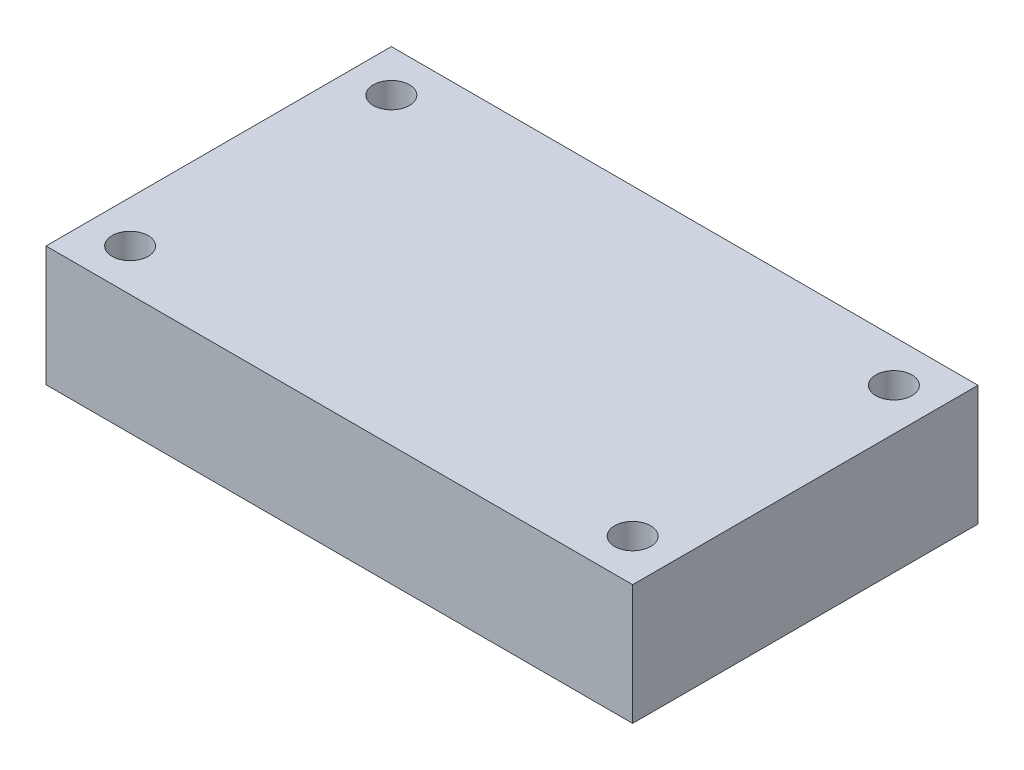
ISO-10303-21;
HEADER;
FILE_DESCRIPTION(('STEP AP214'),'2;1');
FILE_NAME('part.step','',(''),(''),'','','');
FILE_SCHEMA(('AUTOMOTIVE_DESIGN { 1 0 10303 214 1 1 1 1 }'));
ENDSEC;
DATA;
#1=APPLICATION_CONTEXT('core data for automotive mechanical design processes');
#2=APPLICATION_PROTOCOL_DEFINITION('international standard','automotive_design',2000,#1);
#3=PRODUCT_CONTEXT('',#1,'mechanical');
#4=PRODUCT('Part','Part','',(#3));
#5=PRODUCT_RELATED_PRODUCT_CATEGORY('part','',(#4));
#6=PRODUCT_DEFINITION_FORMATION('','',#4);
#7=PRODUCT_DEFINITION_CONTEXT('part definition',#1,'design');
#8=PRODUCT_DEFINITION('design','',#6,#7);
#9=PRODUCT_DEFINITION_SHAPE('','',#8);
#10=(LENGTH_UNIT() NAMED_UNIT(*) SI_UNIT(.MILLI.,.METRE.));
#11=(NAMED_UNIT(*) PLANE_ANGLE_UNIT() SI_UNIT($,.RADIAN.));
#12=(NAMED_UNIT(*) SI_UNIT($,.STERADIAN.) SOLID_ANGLE_UNIT());
#13=UNCERTAINTY_MEASURE_WITH_UNIT(LENGTH_MEASURE(1.E-05),#10,'distance_accuracy_value','');
#14=(GEOMETRIC_REPRESENTATION_CONTEXT(3) GLOBAL_UNCERTAINTY_ASSIGNED_CONTEXT((#13)) GLOBAL_UNIT_ASSIGNED_CONTEXT((#10,
#11,#12)) REPRESENTATION_CONTEXT('',''));
#15=CARTESIAN_POINT('',(0.,0.,0.));
#16=DIRECTION('',(0.,0.,1.));
#17=DIRECTION('',(1.,0.,0.));
#18=AXIS2_PLACEMENT_3D('',#15,#16,#17);
#19=CARTESIAN_POINT('',(31.,12.7,18.25));
#20=DIRECTION('',(-1.,0.,0.));
#21=DIRECTION('',(0.,0.,1.));
#22=AXIS2_PLACEMENT_3D('',#19,#20,#21);
#23=PLANE('',#22);
#24=DIRECTION('',(0.,0.,-1.));
#25=VECTOR('',#24,1.);
#26=CARTESIAN_POINT('',(31.,0.,18.25));
#27=LINE('',#26,#25);
#28=CARTESIAN_POINT('',(31.,0.,18.25));
#29=VERTEX_POINT('',#28);
#30=CARTESIAN_POINT('',(31.,0.,-18.25));
#31=VERTEX_POINT('',#30);
#32=EDGE_CURVE('E102',#29,#31,#27,.T.);
#33=ORIENTED_EDGE('',*,*,#32,.T.);
#34=DIRECTION('',(0.,-1.,0.));
#35=VECTOR('',#34,1.);
#36=CARTESIAN_POINT('',(31.,12.7,-18.25));
#37=LINE('',#36,#35);
#38=CARTESIAN_POINT('',(31.,12.7,-18.25));
#39=VERTEX_POINT('',#38);
#40=EDGE_CURVE('E11',#39,#31,#37,.T.);
#41=ORIENTED_EDGE('',*,*,#40,.F.);
#42=DIRECTION('',(0.,0.,-1.));
#43=VECTOR('',#42,1.);
#44=CARTESIAN_POINT('',(31.,12.7,18.25));
#45=LINE('',#44,#43);
#46=CARTESIAN_POINT('',(31.,12.7,18.25));
#47=VERTEX_POINT('',#46);
#48=EDGE_CURVE('E90',#47,#39,#45,.T.);
#49=ORIENTED_EDGE('',*,*,#48,.F.);
#50=DIRECTION('',(0.,-1.,0.));
#51=VECTOR('',#50,1.);
#52=CARTESIAN_POINT('',(31.,12.7,18.25));
#53=LINE('',#52,#51);
#54=EDGE_CURVE('E98',#47,#29,#53,.T.);
#55=ORIENTED_EDGE('',*,*,#54,.T.);
#56=EDGE_LOOP('',(#33,#41,#49,#55));
#57=FACE_BOUND('',#56,.T.);
#58=ADVANCED_FACE('F39',(#57),#23,.F.);
#59=CARTESIAN_POINT('',(-31.,12.7,-18.25));
#60=DIRECTION('',(0.,0.,1.));
#61=DIRECTION('',(1.,0.,0.));
#62=AXIS2_PLACEMENT_3D('',#59,#60,#61);
#63=PLANE('',#62);
#64=DIRECTION('',(-1.,0.,0.));
#65=VECTOR('',#64,1.);
#66=CARTESIAN_POINT('',(-31.,0.,-18.25));
#67=LINE('',#66,#65);
#68=CARTESIAN_POINT('',(-31.,0.,-18.25));
#69=VERTEX_POINT('',#68);
#70=EDGE_CURVE('E94',#31,#69,#67,.T.);
#71=ORIENTED_EDGE('',*,*,#70,.T.);
#72=DIRECTION('',(0.,-1.,0.));
#73=VECTOR('',#72,1.);
#74=CARTESIAN_POINT('',(-31.,12.7,-18.25));
#75=LINE('',#74,#73);
#76=CARTESIAN_POINT('',(-31.,12.7,-18.25));
#77=VERTEX_POINT('',#76);
#78=EDGE_CURVE('E47',#77,#69,#75,.T.);
#79=ORIENTED_EDGE('',*,*,#78,.F.);
#80=DIRECTION('',(-1.,0.,0.));
#81=VECTOR('',#80,1.);
#82=CARTESIAN_POINT('',(-31.,12.7,-18.25));
#83=LINE('',#82,#81);
#84=EDGE_CURVE('E85',#39,#77,#83,.T.);
#85=ORIENTED_EDGE('',*,*,#84,.F.);
#86=ORIENTED_EDGE('',*,*,#40,.T.);
#87=EDGE_LOOP('',(#71,#79,#85,#86));
#88=FACE_BOUND('',#87,.T.);
#89=ADVANCED_FACE('F93',(#88),#63,.F.);
#90=CARTESIAN_POINT('',(-31.,12.7,18.25));
#91=DIRECTION('',(1.,0.,0.));
#92=DIRECTION('',(0.,0.,-1.));
#93=AXIS2_PLACEMENT_3D('',#90,#91,#92);
#94=PLANE('',#93);
#95=DIRECTION('',(0.,0.,1.));
#96=VECTOR('',#95,1.);
#97=CARTESIAN_POINT('',(-31.,0.,18.25));
#98=LINE('',#97,#96);
#99=CARTESIAN_POINT('',(-31.,0.,18.25));
#100=VERTEX_POINT('',#99);
#101=EDGE_CURVE('E72',#69,#100,#98,.T.);
#102=ORIENTED_EDGE('',*,*,#101,.T.);
#103=DIRECTION('',(0.,-1.,0.));
#104=VECTOR('',#103,1.);
#105=CARTESIAN_POINT('',(-31.,12.7,18.25));
#106=LINE('',#105,#104);
#107=CARTESIAN_POINT('',(-31.,12.7,18.25));
#108=VERTEX_POINT('',#107);
#109=EDGE_CURVE('E95',#108,#100,#106,.T.);
#110=ORIENTED_EDGE('',*,*,#109,.F.);
#111=DIRECTION('',(0.,0.,1.));
#112=VECTOR('',#111,1.);
#113=CARTESIAN_POINT('',(-31.,12.7,18.25));
#114=LINE('',#113,#112);
#115=EDGE_CURVE('E88',#77,#108,#114,.T.);
#116=ORIENTED_EDGE('',*,*,#115,.F.);
#117=ORIENTED_EDGE('',*,*,#78,.T.);
#118=EDGE_LOOP('',(#102,#110,#116,#117));
#119=FACE_BOUND('',#118,.T.);
#120=ADVANCED_FACE('F96',(#119),#94,.F.);
#121=CARTESIAN_POINT('',(-31.,12.7,18.25));
#122=DIRECTION('',(0.,0.,-1.));
#123=DIRECTION('',(-1.,0.,0.));
#124=AXIS2_PLACEMENT_3D('',#121,#122,#123);
#125=PLANE('',#124);
#126=DIRECTION('',(1.,0.,0.));
#127=VECTOR('',#126,1.);
#128=CARTESIAN_POINT('',(-31.,0.,18.25));
#129=LINE('',#128,#127);
#130=EDGE_CURVE('E78',#100,#29,#129,.T.);
#131=ORIENTED_EDGE('',*,*,#130,.T.);
#132=ORIENTED_EDGE('',*,*,#54,.F.);
#133=DIRECTION('',(1.,0.,0.));
#134=VECTOR('',#133,1.);
#135=CARTESIAN_POINT('',(-31.,12.7,18.25));
#136=LINE('',#135,#134);
#137=EDGE_CURVE('E55',#108,#47,#136,.T.);
#138=ORIENTED_EDGE('',*,*,#137,.F.);
#139=ORIENTED_EDGE('',*,*,#109,.T.);
#140=EDGE_LOOP('',(#131,#132,#138,#139));
#141=FACE_BOUND('',#140,.T.);
#142=ADVANCED_FACE('F110',(#141),#125,.F.);
#143=CARTESIAN_POINT('',(0.,12.7,0.));
#144=DIRECTION('',(0.,-1.,0.));
#145=DIRECTION('',(0.,0.,-1.));
#146=AXIS2_PLACEMENT_3D('',#143,#144,#145);
#147=PLANE('',#146);
#148=CARTESIAN_POINT('',(26.555,12.7,13.805));
#149=DIRECTION('',(0.,1.,0.));
#150=DIRECTION('',(0.,0.,1.));
#151=AXIS2_PLACEMENT_3D('',#148,#149,#150);
#152=CIRCLE('',#151,1.905);
#153=CARTESIAN_POINT('',(26.555,12.7,15.71));
#154=VERTEX_POINT('',#153);
#155=EDGE_CURVE('E121',#154,#154,#152,.T.);
#156=ORIENTED_EDGE('',*,*,#155,.F.);
#157=EDGE_LOOP('',(#156));
#158=FACE_BOUND('',#157,.T.);
#159=CARTESIAN_POINT('',(-26.555,12.7,-13.805));
#160=DIRECTION('',(0.,1.,0.));
#161=DIRECTION('',(0.,0.,1.));
#162=AXIS2_PLACEMENT_3D('',#159,#160,#161);
#163=CIRCLE('',#162,1.905);
#164=CARTESIAN_POINT('',(-26.555,12.7,-11.9));
#165=VERTEX_POINT('',#164);
#166=EDGE_CURVE('E122',#165,#165,#163,.T.);
#167=ORIENTED_EDGE('',*,*,#166,.F.);
#168=EDGE_LOOP('',(#167));
#169=FACE_BOUND('',#168,.T.);
#170=CARTESIAN_POINT('',(-26.555,12.7,13.805));
#171=DIRECTION('',(0.,1.,0.));
#172=DIRECTION('',(0.,0.,1.));
#173=AXIS2_PLACEMENT_3D('',#170,#171,#172);
#174=CIRCLE('',#173,1.905);
#175=CARTESIAN_POINT('',(-26.555,12.7,15.71));
#176=VERTEX_POINT('',#175);
#177=EDGE_CURVE('E129',#176,#176,#174,.T.);
#178=ORIENTED_EDGE('',*,*,#177,.F.);
#179=EDGE_LOOP('',(#178));
#180=FACE_BOUND('',#179,.T.);
#181=CARTESIAN_POINT('',(26.555,12.7,-13.805));
#182=DIRECTION('',(0.,1.,0.));
#183=DIRECTION('',(0.,0.,1.));
#184=AXIS2_PLACEMENT_3D('',#181,#182,#183);
#185=CIRCLE('',#184,1.905);
#186=CARTESIAN_POINT('',(26.555,12.7,-11.9));
#187=VERTEX_POINT('',#186);
#188=EDGE_CURVE('E118',#187,#187,#185,.T.);
#189=ORIENTED_EDGE('',*,*,#188,.F.);
#190=EDGE_LOOP('',(#189));
#191=FACE_BOUND('',#190,.T.);
#192=ORIENTED_EDGE('',*,*,#48,.T.);
#193=ORIENTED_EDGE('',*,*,#84,.T.);
#194=ORIENTED_EDGE('',*,*,#115,.T.);
#195=ORIENTED_EDGE('',*,*,#137,.T.);
#196=EDGE_LOOP('',(#192,#193,#194,#195));
#197=FACE_BOUND('',#196,.T.);
#198=ADVANCED_FACE('F86',(#158,#169,#180,#191,#197),#147,.F.);
#199=CARTESIAN_POINT('',(0.,0.,0.));
#200=DIRECTION('',(0.,-1.,0.));
#201=DIRECTION('',(0.,0.,-1.));
#202=AXIS2_PLACEMENT_3D('',#199,#200,#201);
#203=PLANE('',#202);
#204=CARTESIAN_POINT('',(26.555,0.,13.805));
#205=DIRECTION('',(0.,-1.,0.));
#206=DIRECTION('',(0.,0.,-1.));
#207=AXIS2_PLACEMENT_3D('',#204,#205,#206);
#208=CIRCLE('',#207,1.905);
#209=CARTESIAN_POINT('',(26.555,0.,11.9));
#210=VERTEX_POINT('',#209);
#211=EDGE_CURVE('E125',#210,#210,#208,.F.);
#212=ORIENTED_EDGE('',*,*,#211,.T.);
#213=EDGE_LOOP('',(#212));
#214=FACE_BOUND('',#213,.T.);
#215=CARTESIAN_POINT('',(-26.555,0.,-13.805));
#216=DIRECTION('',(0.,-1.,0.));
#217=DIRECTION('',(0.,0.,-1.));
#218=AXIS2_PLACEMENT_3D('',#215,#216,#217);
#219=CIRCLE('',#218,1.905);
#220=CARTESIAN_POINT('',(-26.555,0.,-15.71));
#221=VERTEX_POINT('',#220);
#222=EDGE_CURVE('E126',#221,#221,#219,.F.);
#223=ORIENTED_EDGE('',*,*,#222,.T.);
#224=EDGE_LOOP('',(#223));
#225=FACE_BOUND('',#224,.T.);
#226=CARTESIAN_POINT('',(-26.555,0.,13.805));
#227=DIRECTION('',(0.,-1.,0.));
#228=DIRECTION('',(0.,0.,-1.));
#229=AXIS2_PLACEMENT_3D('',#226,#227,#228);
#230=CIRCLE('',#229,1.905);
#231=CARTESIAN_POINT('',(-26.555,0.,11.9));
#232=VERTEX_POINT('',#231);
#233=EDGE_CURVE('E136',#232,#232,#230,.F.);
#234=ORIENTED_EDGE('',*,*,#233,.T.);
#235=EDGE_LOOP('',(#234));
#236=FACE_BOUND('',#235,.T.);
#237=CARTESIAN_POINT('',(26.555,0.,-13.805));
#238=DIRECTION('',(0.,-1.,0.));
#239=DIRECTION('',(0.,0.,-1.));
#240=AXIS2_PLACEMENT_3D('',#237,#238,#239);
#241=CIRCLE('',#240,1.905);
#242=CARTESIAN_POINT('',(26.555,0.,-15.71));
#243=VERTEX_POINT('',#242);
#244=EDGE_CURVE('E105',#243,#243,#241,.F.);
#245=ORIENTED_EDGE('',*,*,#244,.T.);
#246=EDGE_LOOP('',(#245));
#247=FACE_BOUND('',#246,.T.);
#248=ORIENTED_EDGE('',*,*,#32,.F.);
#249=ORIENTED_EDGE('',*,*,#130,.F.);
#250=ORIENTED_EDGE('',*,*,#101,.F.);
#251=ORIENTED_EDGE('',*,*,#70,.F.);
#252=EDGE_LOOP('',(#248,#249,#250,#251));
#253=FACE_BOUND('',#252,.T.);
#254=ADVANCED_FACE('F113',(#214,#225,#236,#247,#253),#203,.T.);
#255=CARTESIAN_POINT('',(26.555,-5.3881536726415,-13.805));
#256=DIRECTION('',(0.,1.,0.));
#257=DIRECTION('',(0.,0.,1.));
#258=AXIS2_PLACEMENT_3D('',#255,#256,#257);
#259=CYLINDRICAL_SURFACE('',#258,1.905);
#260=ORIENTED_EDGE('',*,*,#188,.T.);
#261=EDGE_LOOP('',(#260));
#262=FACE_BOUND('',#261,.T.);
#263=ORIENTED_EDGE('',*,*,#244,.F.);
#264=EDGE_LOOP('',(#263));
#265=FACE_BOUND('',#264,.T.);
#266=ADVANCED_FACE('F145',(#262,#265),#259,.F.);
#267=CARTESIAN_POINT('',(-26.555,-5.3881536726415,13.805));
#268=DIRECTION('',(0.,1.,0.));
#269=DIRECTION('',(0.,0.,1.));
#270=AXIS2_PLACEMENT_3D('',#267,#268,#269);
#271=CYLINDRICAL_SURFACE('',#270,1.905);
#272=ORIENTED_EDGE('',*,*,#177,.T.);
#273=EDGE_LOOP('',(#272));
#274=FACE_BOUND('',#273,.T.);
#275=ORIENTED_EDGE('',*,*,#233,.F.);
#276=EDGE_LOOP('',(#275));
#277=FACE_BOUND('',#276,.T.);
#278=ADVANCED_FACE('F142',(#274,#277),#271,.F.);
#279=CARTESIAN_POINT('',(-26.555,-5.3881536726415,-13.805));
#280=DIRECTION('',(0.,1.,0.));
#281=DIRECTION('',(0.,0.,1.));
#282=AXIS2_PLACEMENT_3D('',#279,#280,#281);
#283=CYLINDRICAL_SURFACE('',#282,1.905);
#284=ORIENTED_EDGE('',*,*,#166,.T.);
#285=EDGE_LOOP('',(#284));
#286=FACE_BOUND('',#285,.T.);
#287=ORIENTED_EDGE('',*,*,#222,.F.);
#288=EDGE_LOOP('',(#287));
#289=FACE_BOUND('',#288,.T.);
#290=ADVANCED_FACE('F144',(#286,#289),#283,.F.);
#291=CARTESIAN_POINT('',(26.555,-5.3881536726415,13.805));
#292=DIRECTION('',(0.,1.,0.));
#293=DIRECTION('',(0.,0.,1.));
#294=AXIS2_PLACEMENT_3D('',#291,#292,#293);
#295=CYLINDRICAL_SURFACE('',#294,1.905);
#296=ORIENTED_EDGE('',*,*,#155,.T.);
#297=EDGE_LOOP('',(#296));
#298=FACE_BOUND('',#297,.T.);
#299=ORIENTED_EDGE('',*,*,#211,.F.);
#300=EDGE_LOOP('',(#299));
#301=FACE_BOUND('',#300,.T.);
#302=ADVANCED_FACE('F152',(#298,#301),#295,.F.);
#303=CLOSED_SHELL('',(#58,#89,#120,#142,#198,#254,#266,#278,#290,#302));
#304=MANIFOLD_SOLID_BREP('B2',#303);
#305=ADVANCED_BREP_SHAPE_REPRESENTATION('',(#18,#304),#14);
#306=SHAPE_DEFINITION_REPRESENTATION(#9,#305);
ENDSEC;
END-ISO-10303-21;
